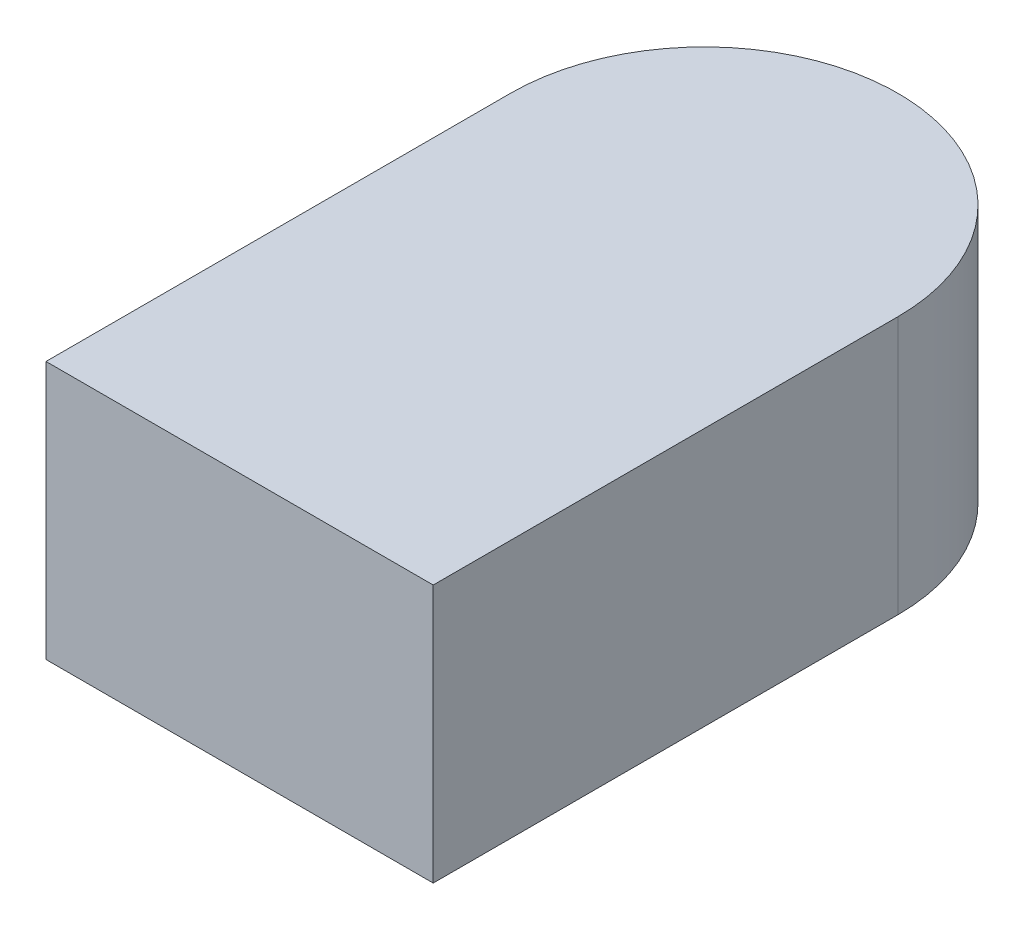
ISO-10303-21;
HEADER;
FILE_DESCRIPTION(('STEP AP214'),'2;1');
FILE_NAME('part.step','',(''),(''),'','','');
FILE_SCHEMA(('AUTOMOTIVE_DESIGN { 1 0 10303 214 1 1 1 1 }'));
ENDSEC;
DATA;
#1=APPLICATION_CONTEXT('core data for automotive mechanical design processes');
#2=APPLICATION_PROTOCOL_DEFINITION('international standard','automotive_design',2000,#1);
#3=PRODUCT_CONTEXT('',#1,'mechanical');
#4=PRODUCT('Part','Part','',(#3));
#5=PRODUCT_RELATED_PRODUCT_CATEGORY('part','',(#4));
#6=PRODUCT_DEFINITION_FORMATION('','',#4);
#7=PRODUCT_DEFINITION_CONTEXT('part definition',#1,'design');
#8=PRODUCT_DEFINITION('design','',#6,#7);
#9=PRODUCT_DEFINITION_SHAPE('','',#8);
#10=(LENGTH_UNIT() NAMED_UNIT(*) SI_UNIT(.MILLI.,.METRE.));
#11=(NAMED_UNIT(*) PLANE_ANGLE_UNIT() SI_UNIT($,.RADIAN.));
#12=(NAMED_UNIT(*) SI_UNIT($,.STERADIAN.) SOLID_ANGLE_UNIT());
#13=UNCERTAINTY_MEASURE_WITH_UNIT(LENGTH_MEASURE(1.E-05),#10,'distance_accuracy_value','');
#14=(GEOMETRIC_REPRESENTATION_CONTEXT(3) GLOBAL_UNCERTAINTY_ASSIGNED_CONTEXT((#13)) GLOBAL_UNIT_ASSIGNED_CONTEXT((#10,
#11,#12)) REPRESENTATION_CONTEXT('',''));
#15=CARTESIAN_POINT('',(0.,0.,0.));
#16=DIRECTION('',(0.,0.,1.));
#17=DIRECTION('',(1.,0.,0.));
#18=AXIS2_PLACEMENT_3D('',#15,#16,#17);
#19=CARTESIAN_POINT('',(0.15,0.2,-0.18));
#20=DIRECTION('',(-1.,0.,0.));
#21=DIRECTION('',(0.,0.,1.));
#22=AXIS2_PLACEMENT_3D('',#19,#20,#21);
#23=PLANE('',#22);
#24=DIRECTION('',(0.,0.,-1.));
#25=VECTOR('',#24,1.);
#26=CARTESIAN_POINT('',(0.15,0.,-0.18));
#27=LINE('',#26,#25);
#28=CARTESIAN_POINT('',(0.15,0.,0.18));
#29=VERTEX_POINT('',#28);
#30=CARTESIAN_POINT('',(0.15,0.,-0.18));
#31=VERTEX_POINT('',#30);
#32=EDGE_CURVE('E100',#29,#31,#27,.T.);
#33=ORIENTED_EDGE('',*,*,#32,.T.);
#34=DIRECTION('',(0.,-1.,0.));
#35=VECTOR('',#34,1.);
#36=CARTESIAN_POINT('',(0.15,0.2,-0.18));
#37=LINE('',#36,#35);
#38=CARTESIAN_POINT('',(0.15,0.2,-0.18));
#39=VERTEX_POINT('',#38);
#40=EDGE_CURVE('E11',#39,#31,#37,.T.);
#41=ORIENTED_EDGE('',*,*,#40,.F.);
#42=DIRECTION('',(0.,0.,-1.));
#43=VECTOR('',#42,1.);
#44=CARTESIAN_POINT('',(0.15,0.2,-0.18));
#45=LINE('',#44,#43);
#46=CARTESIAN_POINT('',(0.15,0.2,0.18));
#47=VERTEX_POINT('',#46);
#48=EDGE_CURVE('E88',#47,#39,#45,.T.);
#49=ORIENTED_EDGE('',*,*,#48,.F.);
#50=DIRECTION('',(0.,-1.,0.));
#51=VECTOR('',#50,1.);
#52=CARTESIAN_POINT('',(0.15,0.2,0.18));
#53=LINE('',#52,#51);
#54=EDGE_CURVE('E96',#47,#29,#53,.T.);
#55=ORIENTED_EDGE('',*,*,#54,.T.);
#56=EDGE_LOOP('',(#33,#41,#49,#55));
#57=FACE_BOUND('',#56,.T.);
#58=ADVANCED_FACE('F37',(#57),#23,.F.);
#59=CARTESIAN_POINT('',(0.,0.2,-0.18));
#60=DIRECTION('',(0.,-1.,0.));
#61=DIRECTION('',(0.,0.,-1.));
#62=AXIS2_PLACEMENT_3D('',#59,#60,#61);
#63=CYLINDRICAL_SURFACE('',#62,0.15);
#64=CARTESIAN_POINT('',(0.,0.,-0.18));
#65=DIRECTION('',(0.,1.,0.));
#66=DIRECTION('',(0.,0.,1.));
#67=AXIS2_PLACEMENT_3D('',#64,#65,#66);
#68=CIRCLE('',#67,0.15);
#69=CARTESIAN_POINT('',(-0.15,0.,-0.18));
#70=VERTEX_POINT('',#69);
#71=EDGE_CURVE('E92',#31,#70,#68,.T.);
#72=ORIENTED_EDGE('',*,*,#71,.T.);
#73=DIRECTION('',(0.,-1.,0.));
#74=VECTOR('',#73,1.);
#75=CARTESIAN_POINT('',(-0.15,0.2,-0.18));
#76=LINE('',#75,#74);
#77=CARTESIAN_POINT('',(-0.15,0.2,-0.18));
#78=VERTEX_POINT('',#77);
#79=EDGE_CURVE('E45',#78,#70,#76,.T.);
#80=ORIENTED_EDGE('',*,*,#79,.F.);
#81=CARTESIAN_POINT('',(0.,0.2,-0.18));
#82=DIRECTION('',(0.,1.,0.));
#83=DIRECTION('',(0.,0.,1.));
#84=AXIS2_PLACEMENT_3D('',#81,#82,#83);
#85=CIRCLE('',#84,0.15);
#86=EDGE_CURVE('E83',#39,#78,#85,.T.);
#87=ORIENTED_EDGE('',*,*,#86,.F.);
#88=ORIENTED_EDGE('',*,*,#40,.T.);
#89=EDGE_LOOP('',(#72,#80,#87,#88));
#90=FACE_BOUND('',#89,.T.);
#91=ADVANCED_FACE('F91',(#90),#63,.T.);
#92=CARTESIAN_POINT('',(-0.15,0.2,-0.18));
#93=DIRECTION('',(1.,0.,0.));
#94=DIRECTION('',(0.,0.,-1.));
#95=AXIS2_PLACEMENT_3D('',#92,#93,#94);
#96=PLANE('',#95);
#97=DIRECTION('',(0.,0.,1.));
#98=VECTOR('',#97,1.);
#99=CARTESIAN_POINT('',(-0.15,0.,-0.18));
#100=LINE('',#99,#98);
#101=CARTESIAN_POINT('',(-0.15,0.,0.18));
#102=VERTEX_POINT('',#101);
#103=EDGE_CURVE('E70',#70,#102,#100,.T.);
#104=ORIENTED_EDGE('',*,*,#103,.T.);
#105=DIRECTION('',(0.,-1.,0.));
#106=VECTOR('',#105,1.);
#107=CARTESIAN_POINT('',(-0.15,0.2,0.18));
#108=LINE('',#107,#106);
#109=CARTESIAN_POINT('',(-0.15,0.2,0.18));
#110=VERTEX_POINT('',#109);
#111=EDGE_CURVE('E93',#110,#102,#108,.T.);
#112=ORIENTED_EDGE('',*,*,#111,.F.);
#113=DIRECTION('',(0.,0.,1.));
#114=VECTOR('',#113,1.);
#115=CARTESIAN_POINT('',(-0.15,0.2,-0.18));
#116=LINE('',#115,#114);
#117=EDGE_CURVE('E86',#78,#110,#116,.T.);
#118=ORIENTED_EDGE('',*,*,#117,.F.);
#119=ORIENTED_EDGE('',*,*,#79,.T.);
#120=EDGE_LOOP('',(#104,#112,#118,#119));
#121=FACE_BOUND('',#120,.T.);
#122=ADVANCED_FACE('F94',(#121),#96,.F.);
#123=CARTESIAN_POINT('',(-0.15,0.2,0.18));
#124=DIRECTION('',(0.,0.,-1.));
#125=DIRECTION('',(-1.,0.,0.));
#126=AXIS2_PLACEMENT_3D('',#123,#124,#125);
#127=PLANE('',#126);
#128=DIRECTION('',(1.,0.,0.));
#129=VECTOR('',#128,1.);
#130=CARTESIAN_POINT('',(-0.15,0.,0.18));
#131=LINE('',#130,#129);
#132=EDGE_CURVE('E76',#102,#29,#131,.T.);
#133=ORIENTED_EDGE('',*,*,#132,.T.);
#134=ORIENTED_EDGE('',*,*,#54,.F.);
#135=DIRECTION('',(1.,0.,0.));
#136=VECTOR('',#135,1.);
#137=CARTESIAN_POINT('',(-0.15,0.2,0.18));
#138=LINE('',#137,#136);
#139=EDGE_CURVE('E53',#110,#47,#138,.T.);
#140=ORIENTED_EDGE('',*,*,#139,.F.);
#141=ORIENTED_EDGE('',*,*,#111,.T.);
#142=EDGE_LOOP('',(#133,#134,#140,#141));
#143=FACE_BOUND('',#142,.T.);
#144=ADVANCED_FACE('F107',(#143),#127,.F.);
#145=CARTESIAN_POINT('',(0.,0.2,-0.18));
#146=DIRECTION('',(0.,1.,0.));
#147=DIRECTION('',(0.,0.,1.));
#148=AXIS2_PLACEMENT_3D('',#145,#146,#147);
#149=PLANE('',#148);
#150=ORIENTED_EDGE('',*,*,#48,.T.);
#151=ORIENTED_EDGE('',*,*,#86,.T.);
#152=ORIENTED_EDGE('',*,*,#117,.T.);
#153=ORIENTED_EDGE('',*,*,#139,.T.);
#154=EDGE_LOOP('',(#150,#151,#152,#153));
#155=FACE_BOUND('',#154,.T.);
#156=ADVANCED_FACE('F84',(#155),#149,.T.);
#157=CARTESIAN_POINT('',(0.,0.,-0.18));
#158=DIRECTION('',(0.,1.,0.));
#159=DIRECTION('',(0.,0.,1.));
#160=AXIS2_PLACEMENT_3D('',#157,#158,#159);
#161=PLANE('',#160);
#162=ORIENTED_EDGE('',*,*,#32,.F.);
#163=ORIENTED_EDGE('',*,*,#132,.F.);
#164=ORIENTED_EDGE('',*,*,#103,.F.);
#165=ORIENTED_EDGE('',*,*,#71,.F.);
#166=EDGE_LOOP('',(#162,#163,#164,#165));
#167=FACE_BOUND('',#166,.T.);
#168=ADVANCED_FACE('F110',(#167),#161,.F.);
#169=CLOSED_SHELL('',(#58,#91,#122,#144,#156,#168));
#170=MANIFOLD_SOLID_BREP('B2',#169);
#171=ADVANCED_BREP_SHAPE_REPRESENTATION('',(#18,#170),#14);
#172=SHAPE_DEFINITION_REPRESENTATION(#9,#171);
ENDSEC;
END-ISO-10303-21;
